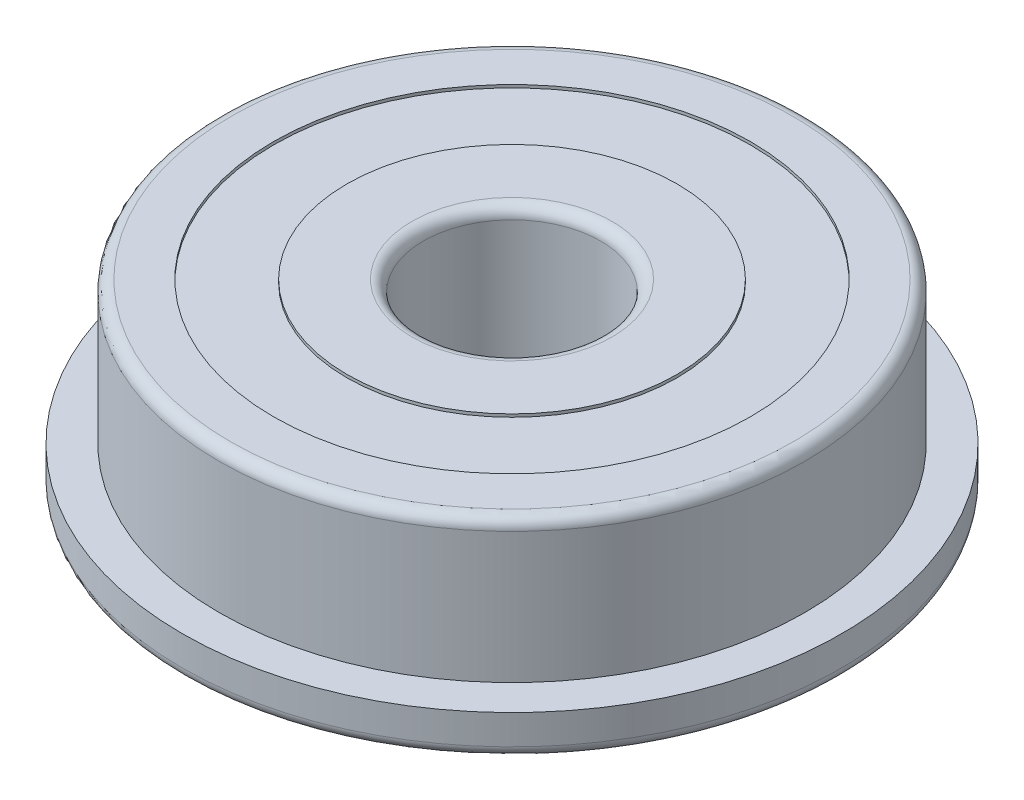
ISO-10303-21;
HEADER;
FILE_DESCRIPTION(('STEP AP214'),'2;1');
FILE_NAME('part.step','',(''),(''),'','','');
FILE_SCHEMA(('AUTOMOTIVE_DESIGN { 1 0 10303 214 1 1 1 1 }'));
ENDSEC;
DATA;
#1=APPLICATION_CONTEXT('core data for automotive mechanical design processes');
#2=APPLICATION_PROTOCOL_DEFINITION('international standard','automotive_design',2000,#1);
#3=PRODUCT_CONTEXT('',#1,'mechanical');
#4=PRODUCT('Part','Part','',(#3));
#5=PRODUCT_RELATED_PRODUCT_CATEGORY('part','',(#4));
#6=PRODUCT_DEFINITION_FORMATION('','',#4);
#7=PRODUCT_DEFINITION_CONTEXT('part definition',#1,'design');
#8=PRODUCT_DEFINITION('design','',#6,#7);
#9=PRODUCT_DEFINITION_SHAPE('','',#8);
#10=(LENGTH_UNIT() NAMED_UNIT(*) SI_UNIT(.MILLI.,.METRE.));
#11=(NAMED_UNIT(*) PLANE_ANGLE_UNIT() SI_UNIT($,.RADIAN.));
#12=(NAMED_UNIT(*) SI_UNIT($,.STERADIAN.) SOLID_ANGLE_UNIT());
#13=UNCERTAINTY_MEASURE_WITH_UNIT(LENGTH_MEASURE(1.E-05),#10,'distance_accuracy_value','');
#14=(GEOMETRIC_REPRESENTATION_CONTEXT(3) GLOBAL_UNCERTAINTY_ASSIGNED_CONTEXT((#13)) GLOBAL_UNIT_ASSIGNED_CONTEXT((#10,
#11,#12)) REPRESENTATION_CONTEXT('',''));
#15=CARTESIAN_POINT('',(0.,0.,0.));
#16=DIRECTION('',(0.,0.,1.));
#17=DIRECTION('',(1.,0.,0.));
#18=AXIS2_PLACEMENT_3D('',#15,#16,#17);
#19=CARTESIAN_POINT('',(0.,5.,0.));
#20=DIRECTION('',(0.,1.,0.));
#21=DIRECTION('',(0.,0.,1.));
#22=AXIS2_PLACEMENT_3D('',#19,#20,#21);
#23=PLANE('',#22);
#24=CARTESIAN_POINT('',(0.,5.,0.));
#25=DIRECTION('',(0.,1.,0.));
#26=DIRECTION('',(0.,0.,1.));
#27=AXIS2_PLACEMENT_3D('',#24,#25,#26);
#28=CIRCLE('',#27,2.73);
#29=CARTESIAN_POINT('',(0.,5.,2.73));
#30=VERTEX_POINT('',#29);
#31=EDGE_CURVE('E10',#30,#30,#28,.F.);
#32=ORIENTED_EDGE('',*,*,#31,.T.);
#33=EDGE_LOOP('',(#32));
#34=FACE_BOUND('',#33,.T.);
#35=CARTESIAN_POINT('',(0.,5.,0.));
#36=DIRECTION('',(0.,1.,0.));
#37=DIRECTION('',(0.,0.,1.));
#38=AXIS2_PLACEMENT_3D('',#35,#36,#37);
#39=CIRCLE('',#38,4.5);
#40=CARTESIAN_POINT('',(0.,5.,4.5));
#41=VERTEX_POINT('',#40);
#42=EDGE_CURVE('E89',#41,#41,#39,.T.);
#43=ORIENTED_EDGE('',*,*,#42,.T.);
#44=EDGE_LOOP('',(#43));
#45=FACE_BOUND('',#44,.T.);
#46=ADVANCED_FACE('F32',(#34,#45),#23,.T.);
#47=CARTESIAN_POINT('',(0.,0.,0.));
#48=DIRECTION('',(0.,1.,0.));
#49=DIRECTION('',(0.,0.,1.));
#50=AXIS2_PLACEMENT_3D('',#47,#48,#49);
#51=PLANE('',#50);
#52=CARTESIAN_POINT('',(0.,0.,0.));
#53=DIRECTION('',(0.,1.,0.));
#54=DIRECTION('',(0.,0.,1.));
#55=AXIS2_PLACEMENT_3D('',#52,#53,#54);
#56=CIRCLE('',#55,2.73);
#57=CARTESIAN_POINT('',(0.,0.,2.73));
#58=VERTEX_POINT('',#57);
#59=EDGE_CURVE('E61',#58,#58,#56,.T.);
#60=ORIENTED_EDGE('',*,*,#59,.T.);
#61=EDGE_LOOP('',(#60));
#62=FACE_BOUND('',#61,.T.);
#63=CARTESIAN_POINT('',(0.,0.,0.));
#64=DIRECTION('',(0.,-1.,0.));
#65=DIRECTION('',(0.,0.,-1.));
#66=AXIS2_PLACEMENT_3D('',#63,#64,#65);
#67=CIRCLE('',#66,4.5);
#68=CARTESIAN_POINT('',(0.,0.,-4.5));
#69=VERTEX_POINT('',#68);
#70=EDGE_CURVE('E77',#69,#69,#67,.T.);
#71=ORIENTED_EDGE('',*,*,#70,.T.);
#72=EDGE_LOOP('',(#71));
#73=FACE_BOUND('',#72,.T.);
#74=ADVANCED_FACE('F127',(#62,#73),#51,.F.);
#75=CARTESIAN_POINT('',(0.,1.12,0.));
#76=DIRECTION('',(0.,-1.,0.));
#77=DIRECTION('',(0.,0.,-1.));
#78=AXIS2_PLACEMENT_3D('',#75,#76,#77);
#79=CYLINDRICAL_SURFACE('',#78,8.985);
#80=CARTESIAN_POINT('',(0.,0.31,0.));
#81=DIRECTION('',(0.,1.,0.));
#82=DIRECTION('',(0.,0.,1.));
#83=AXIS2_PLACEMENT_3D('',#80,#81,#82);
#84=CIRCLE('',#83,8.985);
#85=CARTESIAN_POINT('',(0.,0.31,8.985));
#86=VERTEX_POINT('',#85);
#87=EDGE_CURVE('E52',#86,#86,#84,.T.);
#88=ORIENTED_EDGE('',*,*,#87,.T.);
#89=EDGE_LOOP('',(#88));
#90=FACE_BOUND('',#89,.T.);
#91=CARTESIAN_POINT('',(0.,1.12,0.));
#92=DIRECTION('',(0.,1.,0.));
#93=DIRECTION('',(0.,0.,1.));
#94=AXIS2_PLACEMENT_3D('',#91,#92,#93);
#95=CIRCLE('',#94,8.985);
#96=CARTESIAN_POINT('',(0.,1.12,8.985));
#97=VERTEX_POINT('',#96);
#98=EDGE_CURVE('E65',#97,#97,#95,.T.);
#99=ORIENTED_EDGE('',*,*,#98,.F.);
#100=EDGE_LOOP('',(#99));
#101=FACE_BOUND('',#100,.T.);
#102=ADVANCED_FACE('F131',(#90,#101),#79,.T.);
#103=CARTESIAN_POINT('',(0.,1.12,0.));
#104=DIRECTION('',(0.,1.,0.));
#105=DIRECTION('',(0.,0.,1.));
#106=AXIS2_PLACEMENT_3D('',#103,#104,#105);
#107=PLANE('',#106);
#108=CARTESIAN_POINT('',(0.,1.12,0.));
#109=DIRECTION('',(0.,1.,0.));
#110=DIRECTION('',(0.,0.,1.));
#111=AXIS2_PLACEMENT_3D('',#108,#109,#110);
#112=CIRCLE('',#111,7.985);
#113=CARTESIAN_POINT('',(0.,1.12,7.985));
#114=VERTEX_POINT('',#113);
#115=EDGE_CURVE('E64',#114,#114,#112,.T.);
#116=ORIENTED_EDGE('',*,*,#115,.F.);
#117=EDGE_LOOP('',(#116));
#118=FACE_BOUND('',#117,.T.);
#119=ORIENTED_EDGE('',*,*,#98,.T.);
#120=EDGE_LOOP('',(#119));
#121=FACE_BOUND('',#120,.T.);
#122=ADVANCED_FACE('F162',(#118,#121),#107,.T.);
#123=CARTESIAN_POINT('',(0.,0.,0.));
#124=DIRECTION('',(0.,1.,0.));
#125=DIRECTION('',(0.,0.,1.));
#126=AXIS2_PLACEMENT_3D('',#123,#124,#125);
#127=CIRCLE('',#126,8.675);
#128=CARTESIAN_POINT('',(0.,0.,8.675));
#129=VERTEX_POINT('',#128);
#130=EDGE_CURVE('E47',#129,#129,#127,.F.);
#131=ORIENTED_EDGE('',*,*,#130,.T.);
#132=EDGE_LOOP('',(#131));
#133=FACE_BOUND('',#132,.T.);
#134=CARTESIAN_POINT('',(0.,0.,0.));
#135=DIRECTION('',(0.,-1.,0.));
#136=DIRECTION('',(0.,0.,-1.));
#137=AXIS2_PLACEMENT_3D('',#134,#135,#136);
#138=CIRCLE('',#137,6.5);
#139=CARTESIAN_POINT('',(0.,0.,-6.5));
#140=VERTEX_POINT('',#139);
#141=EDGE_CURVE('E71',#140,#140,#138,.T.);
#142=ORIENTED_EDGE('',*,*,#141,.F.);
#143=EDGE_LOOP('',(#142));
#144=FACE_BOUND('',#143,.T.);
#145=ADVANCED_FACE('F124',(#133,#144),#51,.F.);
#146=CARTESIAN_POINT('',(0.,5.,0.));
#147=DIRECTION('',(0.,-1.,0.));
#148=DIRECTION('',(0.,0.,-1.));
#149=AXIS2_PLACEMENT_3D('',#146,#147,#148);
#150=CYLINDRICAL_SURFACE('',#149,7.985);
#151=CARTESIAN_POINT('',(0.,4.69,0.));
#152=DIRECTION('',(0.,1.,0.));
#153=DIRECTION('',(0.,0.,1.));
#154=AXIS2_PLACEMENT_3D('',#151,#152,#153);
#155=CIRCLE('',#154,7.985);
#156=CARTESIAN_POINT('',(0.,4.69,7.985));
#157=VERTEX_POINT('',#156);
#158=EDGE_CURVE('E39',#157,#157,#155,.F.);
#159=ORIENTED_EDGE('',*,*,#158,.T.);
#160=EDGE_LOOP('',(#159));
#161=FACE_BOUND('',#160,.T.);
#162=ORIENTED_EDGE('',*,*,#115,.T.);
#163=EDGE_LOOP('',(#162));
#164=FACE_BOUND('',#163,.T.);
#165=ADVANCED_FACE('F114',(#161,#164),#150,.T.);
#166=CARTESIAN_POINT('',(0.,5.,0.));
#167=DIRECTION('',(0.,1.,0.));
#168=DIRECTION('',(0.,0.,1.));
#169=AXIS2_PLACEMENT_3D('',#166,#167,#168);
#170=CIRCLE('',#169,7.675);
#171=CARTESIAN_POINT('',(0.,5.,7.675));
#172=VERTEX_POINT('',#171);
#173=EDGE_CURVE('E43',#172,#172,#170,.T.);
#174=ORIENTED_EDGE('',*,*,#173,.T.);
#175=EDGE_LOOP('',(#174));
#176=FACE_BOUND('',#175,.T.);
#177=CARTESIAN_POINT('',(0.,5.,0.));
#178=DIRECTION('',(0.,1.,0.));
#179=DIRECTION('',(0.,0.,1.));
#180=AXIS2_PLACEMENT_3D('',#177,#178,#179);
#181=CIRCLE('',#180,6.5);
#182=CARTESIAN_POINT('',(0.,5.,6.5));
#183=VERTEX_POINT('',#182);
#184=EDGE_CURVE('E83',#183,#183,#181,.T.);
#185=ORIENTED_EDGE('',*,*,#184,.F.);
#186=EDGE_LOOP('',(#185));
#187=FACE_BOUND('',#186,.T.);
#188=ADVANCED_FACE('F111',(#176,#187),#23,.T.);
#189=CARTESIAN_POINT('',(0.,0.,0.));
#190=DIRECTION('',(0.,1.,0.));
#191=DIRECTION('',(0.,0.,1.));
#192=AXIS2_PLACEMENT_3D('',#189,#190,#191);
#193=CYLINDRICAL_SURFACE('',#192,2.42);
#194=CARTESIAN_POINT('',(0.,0.31,0.));
#195=DIRECTION('',(0.,1.,0.));
#196=DIRECTION('',(0.,0.,1.));
#197=AXIS2_PLACEMENT_3D('',#194,#195,#196);
#198=CIRCLE('',#197,2.42);
#199=CARTESIAN_POINT('',(0.,0.31,2.42));
#200=VERTEX_POINT('',#199);
#201=EDGE_CURVE('E55',#200,#200,#198,.F.);
#202=ORIENTED_EDGE('',*,*,#201,.T.);
#203=EDGE_LOOP('',(#202));
#204=FACE_BOUND('',#203,.T.);
#205=CARTESIAN_POINT('',(0.,4.69,0.));
#206=DIRECTION('',(0.,1.,0.));
#207=DIRECTION('',(0.,0.,1.));
#208=AXIS2_PLACEMENT_3D('',#205,#206,#207);
#209=CIRCLE('',#208,2.42);
#210=CARTESIAN_POINT('',(0.,4.69,2.42));
#211=VERTEX_POINT('',#210);
#212=EDGE_CURVE('E58',#211,#211,#209,.T.);
#213=ORIENTED_EDGE('',*,*,#212,.T.);
#214=EDGE_LOOP('',(#213));
#215=FACE_BOUND('',#214,.T.);
#216=ADVANCED_FACE('F113',(#204,#215),#193,.F.);
#217=CARTESIAN_POINT('',(0.,0.08,0.));
#218=DIRECTION('',(0.,-1.,0.));
#219=DIRECTION('',(0.,0.,-1.));
#220=AXIS2_PLACEMENT_3D('',#217,#218,#219);
#221=CYLINDRICAL_SURFACE('',#220,6.5);
#222=CARTESIAN_POINT('',(0.,0.08,0.));
#223=DIRECTION('',(0.,-1.,0.));
#224=DIRECTION('',(0.,0.,-1.));
#225=AXIS2_PLACEMENT_3D('',#222,#223,#224);
#226=CIRCLE('',#225,6.5);
#227=CARTESIAN_POINT('',(0.,0.08,-6.5));
#228=VERTEX_POINT('',#227);
#229=EDGE_CURVE('E68',#228,#228,#226,.T.);
#230=ORIENTED_EDGE('',*,*,#229,.F.);
#231=EDGE_LOOP('',(#230));
#232=FACE_BOUND('',#231,.T.);
#233=ORIENTED_EDGE('',*,*,#141,.T.);
#234=EDGE_LOOP('',(#233));
#235=FACE_BOUND('',#234,.T.);
#236=ADVANCED_FACE('F121',(#232,#235),#221,.F.);
#237=CARTESIAN_POINT('',(0.,0.08,0.));
#238=DIRECTION('',(0.,-1.,0.));
#239=DIRECTION('',(0.,0.,-1.));
#240=AXIS2_PLACEMENT_3D('',#237,#238,#239);
#241=PLANE('',#240);
#242=CARTESIAN_POINT('',(0.,0.08,0.));
#243=DIRECTION('',(0.,-1.,0.));
#244=DIRECTION('',(0.,0.,-1.));
#245=AXIS2_PLACEMENT_3D('',#242,#243,#244);
#246=CIRCLE('',#245,4.5);
#247=CARTESIAN_POINT('',(0.,0.08,-4.5));
#248=VERTEX_POINT('',#247);
#249=EDGE_CURVE('E74',#248,#248,#246,.T.);
#250=ORIENTED_EDGE('',*,*,#249,.F.);
#251=EDGE_LOOP('',(#250));
#252=FACE_BOUND('',#251,.T.);
#253=ORIENTED_EDGE('',*,*,#229,.T.);
#254=EDGE_LOOP('',(#253));
#255=FACE_BOUND('',#254,.T.);
#256=ADVANCED_FACE('F148',(#252,#255),#241,.T.);
#257=CARTESIAN_POINT('',(0.,0.08,0.));
#258=DIRECTION('',(0.,-1.,0.));
#259=DIRECTION('',(0.,0.,-1.));
#260=AXIS2_PLACEMENT_3D('',#257,#258,#259);
#261=CYLINDRICAL_SURFACE('',#260,4.5);
#262=ORIENTED_EDGE('',*,*,#249,.T.);
#263=EDGE_LOOP('',(#262));
#264=FACE_BOUND('',#263,.T.);
#265=ORIENTED_EDGE('',*,*,#70,.F.);
#266=EDGE_LOOP('',(#265));
#267=FACE_BOUND('',#266,.T.);
#268=ADVANCED_FACE('F107',(#264,#267),#261,.T.);
#269=CARTESIAN_POINT('',(0.,4.92,0.));
#270=DIRECTION('',(0.,1.,0.));
#271=DIRECTION('',(0.,0.,1.));
#272=AXIS2_PLACEMENT_3D('',#269,#270,#271);
#273=CYLINDRICAL_SURFACE('',#272,6.5);
#274=CARTESIAN_POINT('',(0.,4.92,0.));
#275=DIRECTION('',(0.,1.,0.));
#276=DIRECTION('',(0.,0.,1.));
#277=AXIS2_PLACEMENT_3D('',#274,#275,#276);
#278=CIRCLE('',#277,6.5);
#279=CARTESIAN_POINT('',(0.,4.92,6.5));
#280=VERTEX_POINT('',#279);
#281=EDGE_CURVE('E80',#280,#280,#278,.T.);
#282=ORIENTED_EDGE('',*,*,#281,.F.);
#283=EDGE_LOOP('',(#282));
#284=FACE_BOUND('',#283,.T.);
#285=ORIENTED_EDGE('',*,*,#184,.T.);
#286=EDGE_LOOP('',(#285));
#287=FACE_BOUND('',#286,.T.);
#288=ADVANCED_FACE('F101',(#284,#287),#273,.F.);
#289=CARTESIAN_POINT('',(0.,4.92,0.));
#290=DIRECTION('',(0.,1.,0.));
#291=DIRECTION('',(0.,0.,1.));
#292=AXIS2_PLACEMENT_3D('',#289,#290,#291);
#293=PLANE('',#292);
#294=CARTESIAN_POINT('',(0.,4.92,0.));
#295=DIRECTION('',(0.,1.,0.));
#296=DIRECTION('',(0.,0.,1.));
#297=AXIS2_PLACEMENT_3D('',#294,#295,#296);
#298=CIRCLE('',#297,4.5);
#299=CARTESIAN_POINT('',(0.,4.92,4.5));
#300=VERTEX_POINT('',#299);
#301=EDGE_CURVE('E86',#300,#300,#298,.T.);
#302=ORIENTED_EDGE('',*,*,#301,.F.);
#303=EDGE_LOOP('',(#302));
#304=FACE_BOUND('',#303,.T.);
#305=ORIENTED_EDGE('',*,*,#281,.T.);
#306=EDGE_LOOP('',(#305));
#307=FACE_BOUND('',#306,.T.);
#308=ADVANCED_FACE('F98',(#304,#307),#293,.T.);
#309=CARTESIAN_POINT('',(0.,4.92,0.));
#310=DIRECTION('',(0.,1.,0.));
#311=DIRECTION('',(0.,0.,1.));
#312=AXIS2_PLACEMENT_3D('',#309,#310,#311);
#313=CYLINDRICAL_SURFACE('',#312,4.5);
#314=ORIENTED_EDGE('',*,*,#301,.T.);
#315=EDGE_LOOP('',(#314));
#316=FACE_BOUND('',#315,.T.);
#317=ORIENTED_EDGE('',*,*,#42,.F.);
#318=EDGE_LOOP('',(#317));
#319=FACE_BOUND('',#318,.T.);
#320=ADVANCED_FACE('F95',(#316,#319),#313,.T.);
#321=CARTESIAN_POINT('',(0.,0.31,0.));
#322=DIRECTION('',(0.,1.,0.));
#323=DIRECTION('',(0.,0.,1.));
#324=AXIS2_PLACEMENT_3D('',#321,#322,#323);
#325=TOROIDAL_SURFACE('',#324,2.73,0.31);
#326=ORIENTED_EDGE('',*,*,#201,.F.);
#327=EDGE_LOOP('',(#326));
#328=FACE_BOUND('',#327,.T.);
#329=ORIENTED_EDGE('',*,*,#59,.F.);
#330=EDGE_LOOP('',(#329));
#331=FACE_BOUND('',#330,.T.);
#332=ADVANCED_FACE('F137',(#328,#331),#325,.T.);
#333=CARTESIAN_POINT('',(0.,0.31,0.));
#334=DIRECTION('',(0.,1.,0.));
#335=DIRECTION('',(0.,0.,1.));
#336=AXIS2_PLACEMENT_3D('',#333,#334,#335);
#337=TOROIDAL_SURFACE('',#336,8.675,0.31);
#338=ORIENTED_EDGE('',*,*,#130,.F.);
#339=EDGE_LOOP('',(#338));
#340=FACE_BOUND('',#339,.T.);
#341=ORIENTED_EDGE('',*,*,#87,.F.);
#342=EDGE_LOOP('',(#341));
#343=FACE_BOUND('',#342,.T.);
#344=ADVANCED_FACE('F142',(#340,#343),#337,.T.);
#345=CARTESIAN_POINT('',(0.,4.69,0.));
#346=DIRECTION('',(0.,1.,0.));
#347=DIRECTION('',(0.,0.,1.));
#348=AXIS2_PLACEMENT_3D('',#345,#346,#347);
#349=TOROIDAL_SURFACE('',#348,7.675,0.31);
#350=ORIENTED_EDGE('',*,*,#158,.F.);
#351=EDGE_LOOP('',(#350));
#352=FACE_BOUND('',#351,.T.);
#353=ORIENTED_EDGE('',*,*,#173,.F.);
#354=EDGE_LOOP('',(#353));
#355=FACE_BOUND('',#354,.T.);
#356=ADVANCED_FACE('F174',(#352,#355),#349,.T.);
#357=CARTESIAN_POINT('',(0.,4.69,0.));
#358=DIRECTION('',(0.,1.,0.));
#359=DIRECTION('',(0.,0.,1.));
#360=AXIS2_PLACEMENT_3D('',#357,#358,#359);
#361=TOROIDAL_SURFACE('',#360,2.73,0.31);
#362=ORIENTED_EDGE('',*,*,#31,.F.);
#363=EDGE_LOOP('',(#362));
#364=FACE_BOUND('',#363,.T.);
#365=ORIENTED_EDGE('',*,*,#212,.F.);
#366=EDGE_LOOP('',(#365));
#367=FACE_BOUND('',#366,.T.);
#368=ADVANCED_FACE('F34',(#364,#367),#361,.T.);
#369=CLOSED_SHELL('',(#46,#74,#102,#122,#145,#165,#188,#216,#236,#256,#268,#288,#308,#320,#332,
#344,#356,#368));
#370=MANIFOLD_SOLID_BREP('B2',#369);
#371=ADVANCED_BREP_SHAPE_REPRESENTATION('',(#18,#370),#14);
#372=SHAPE_DEFINITION_REPRESENTATION(#9,#371);
ENDSEC;
END-ISO-10303-21;
